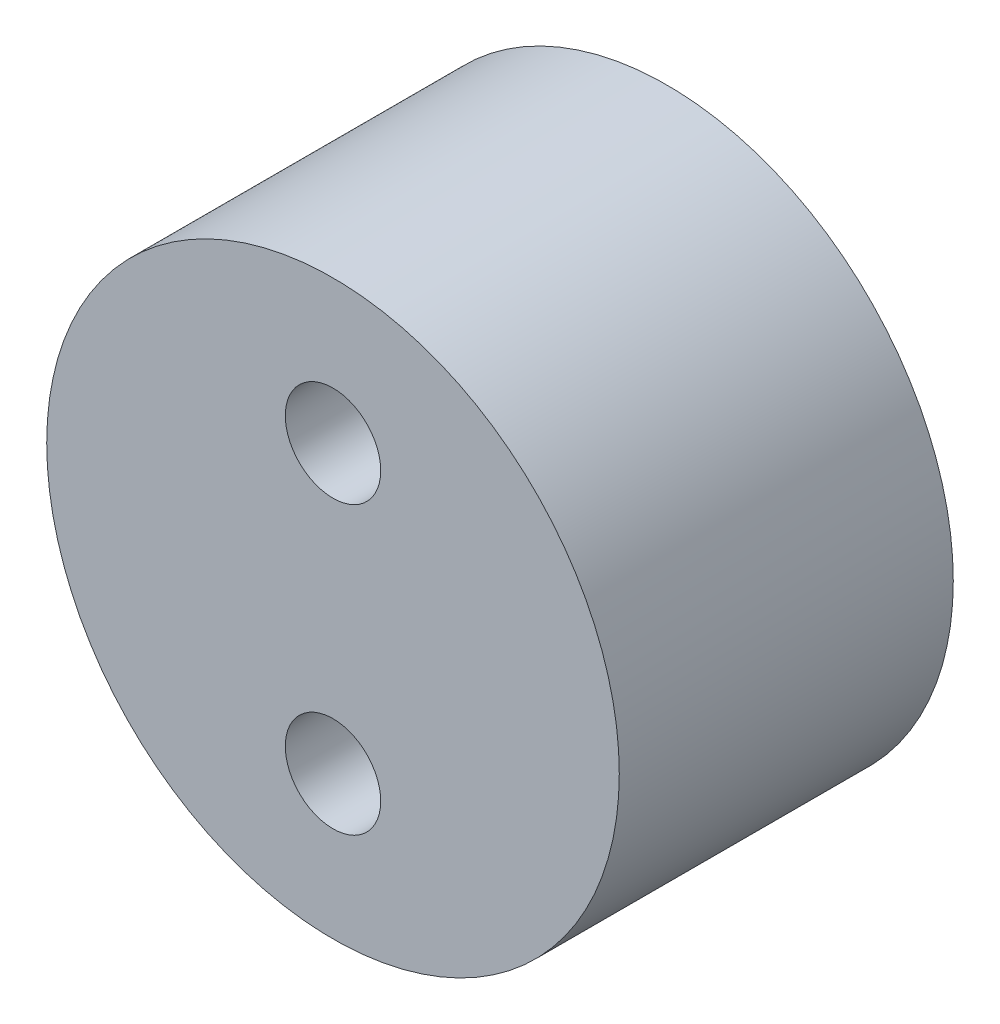
ISO-10303-21;
HEADER;
FILE_DESCRIPTION(('STEP AP214'),'2;1');
FILE_NAME('part.step','',(''),(''),'','','');
FILE_SCHEMA(('AUTOMOTIVE_DESIGN { 1 0 10303 214 1 1 1 1 }'));
ENDSEC;
DATA;
#1=APPLICATION_CONTEXT('core data for automotive mechanical design processes');
#2=APPLICATION_PROTOCOL_DEFINITION('international standard','automotive_design',2000,#1);
#3=PRODUCT_CONTEXT('',#1,'mechanical');
#4=PRODUCT('Part','Part','',(#3));
#5=PRODUCT_RELATED_PRODUCT_CATEGORY('part','',(#4));
#6=PRODUCT_DEFINITION_FORMATION('','',#4);
#7=PRODUCT_DEFINITION_CONTEXT('part definition',#1,'design');
#8=PRODUCT_DEFINITION('design','',#6,#7);
#9=PRODUCT_DEFINITION_SHAPE('','',#8);
#10=(LENGTH_UNIT() NAMED_UNIT(*) SI_UNIT(.MILLI.,.METRE.));
#11=(NAMED_UNIT(*) PLANE_ANGLE_UNIT() SI_UNIT($,.RADIAN.));
#12=(NAMED_UNIT(*) SI_UNIT($,.STERADIAN.) SOLID_ANGLE_UNIT());
#13=UNCERTAINTY_MEASURE_WITH_UNIT(LENGTH_MEASURE(1.E-05),#10,'distance_accuracy_value','');
#14=(GEOMETRIC_REPRESENTATION_CONTEXT(3) GLOBAL_UNCERTAINTY_ASSIGNED_CONTEXT((#13)) GLOBAL_UNIT_ASSIGNED_CONTEXT((#10,
#11,#12)) REPRESENTATION_CONTEXT('',''));
#15=CARTESIAN_POINT('',(0.,0.,0.));
#16=DIRECTION('',(0.,0.,1.));
#17=DIRECTION('',(1.,0.,0.));
#18=AXIS2_PLACEMENT_3D('',#15,#16,#17);
#19=CARTESIAN_POINT('',(0.,0.,17.5));
#20=DIRECTION('',(0.,0.,1.));
#21=DIRECTION('',(1.,0.,0.));
#22=AXIS2_PLACEMENT_3D('',#19,#20,#21);
#23=PLANE('',#22);
#24=CARTESIAN_POINT('',(0.,7.5,17.5));
#25=DIRECTION('',(0.,0.,1.));
#26=DIRECTION('',(1.,0.,0.));
#27=AXIS2_PLACEMENT_3D('',#24,#25,#26);
#28=CIRCLE('',#27,2.5);
#29=CARTESIAN_POINT('',(2.5,7.5,17.5));
#30=VERTEX_POINT('',#29);
#31=EDGE_CURVE('E50',#30,#30,#28,.T.);
#32=ORIENTED_EDGE('',*,*,#31,.F.);
#33=EDGE_LOOP('',(#32));
#34=FACE_BOUND('',#33,.T.);
#35=CARTESIAN_POINT('',(0.,0.,17.5));
#36=DIRECTION('',(0.,0.,1.));
#37=DIRECTION('',(1.,0.,0.));
#38=AXIS2_PLACEMENT_3D('',#35,#36,#37);
#39=CIRCLE('',#38,15.);
#40=CARTESIAN_POINT('',(15.,0.,17.5));
#41=VERTEX_POINT('',#40);
#42=EDGE_CURVE('E10',#41,#41,#39,.T.);
#43=ORIENTED_EDGE('',*,*,#42,.T.);
#44=EDGE_LOOP('',(#43));
#45=FACE_BOUND('',#44,.T.);
#46=CARTESIAN_POINT('',(0.,-7.5,17.5));
#47=DIRECTION('',(0.,0.,1.));
#48=DIRECTION('',(1.,0.,0.));
#49=AXIS2_PLACEMENT_3D('',#46,#47,#48);
#50=CIRCLE('',#49,2.5);
#51=CARTESIAN_POINT('',(2.5,-7.5,17.5));
#52=VERTEX_POINT('',#51);
#53=EDGE_CURVE('E56',#52,#52,#50,.T.);
#54=ORIENTED_EDGE('',*,*,#53,.F.);
#55=EDGE_LOOP('',(#54));
#56=FACE_BOUND('',#55,.T.);
#57=ADVANCED_FACE('F37',(#34,#45,#56),#23,.T.);
#58=CARTESIAN_POINT('',(0.,0.,0.));
#59=DIRECTION('',(0.,0.,1.));
#60=DIRECTION('',(1.,0.,0.));
#61=AXIS2_PLACEMENT_3D('',#58,#59,#60);
#62=PLANE('',#61);
#63=CARTESIAN_POINT('',(0.,0.,0.));
#64=DIRECTION('',(0.,0.,1.));
#65=DIRECTION('',(1.,0.,0.));
#66=AXIS2_PLACEMENT_3D('',#63,#64,#65);
#67=CIRCLE('',#66,15.);
#68=CARTESIAN_POINT('',(15.,0.,0.));
#69=VERTEX_POINT('',#68);
#70=EDGE_CURVE('E41',#69,#69,#67,.T.);
#71=ORIENTED_EDGE('',*,*,#70,.F.);
#72=EDGE_LOOP('',(#71));
#73=FACE_BOUND('',#72,.T.);
#74=CARTESIAN_POINT('',(0.,7.5,0.));
#75=DIRECTION('',(0.,0.,1.));
#76=DIRECTION('',(1.,0.,0.));
#77=AXIS2_PLACEMENT_3D('',#74,#75,#76);
#78=CIRCLE('',#77,2.5);
#79=CARTESIAN_POINT('',(2.5,7.5,0.));
#80=VERTEX_POINT('',#79);
#81=EDGE_CURVE('E52',#80,#80,#78,.T.);
#82=ORIENTED_EDGE('',*,*,#81,.T.);
#83=EDGE_LOOP('',(#82));
#84=FACE_BOUND('',#83,.T.);
#85=CARTESIAN_POINT('',(0.,-7.5,0.));
#86=DIRECTION('',(0.,0.,1.));
#87=DIRECTION('',(1.,0.,0.));
#88=AXIS2_PLACEMENT_3D('',#85,#86,#87);
#89=CIRCLE('',#88,2.5);
#90=CARTESIAN_POINT('',(2.5,-7.5,0.));
#91=VERTEX_POINT('',#90);
#92=EDGE_CURVE('E60',#91,#91,#89,.T.);
#93=ORIENTED_EDGE('',*,*,#92,.T.);
#94=EDGE_LOOP('',(#93));
#95=FACE_BOUND('',#94,.T.);
#96=ADVANCED_FACE('F72',(#73,#84,#95),#62,.F.);
#97=CARTESIAN_POINT('',(0.,0.,17.5));
#98=DIRECTION('',(0.,0.,-1.));
#99=DIRECTION('',(-1.,0.,0.));
#100=AXIS2_PLACEMENT_3D('',#97,#98,#99);
#101=CYLINDRICAL_SURFACE('',#100,15.);
#102=ORIENTED_EDGE('',*,*,#42,.F.);
#103=EDGE_LOOP('',(#102));
#104=FACE_BOUND('',#103,.T.);
#105=ORIENTED_EDGE('',*,*,#70,.T.);
#106=EDGE_LOOP('',(#105));
#107=FACE_BOUND('',#106,.T.);
#108=ADVANCED_FACE('F39',(#104,#107),#101,.T.);
#109=CARTESIAN_POINT('',(0.,7.5,17.5));
#110=DIRECTION('',(0.,0.,-1.));
#111=DIRECTION('',(-1.,0.,0.));
#112=AXIS2_PLACEMENT_3D('',#109,#110,#111);
#113=CYLINDRICAL_SURFACE('',#112,2.5);
#114=ORIENTED_EDGE('',*,*,#31,.T.);
#115=EDGE_LOOP('',(#114));
#116=FACE_BOUND('',#115,.T.);
#117=ORIENTED_EDGE('',*,*,#81,.F.);
#118=EDGE_LOOP('',(#117));
#119=FACE_BOUND('',#118,.T.);
#120=ADVANCED_FACE('F81',(#116,#119),#113,.F.);
#121=CARTESIAN_POINT('',(0.,-7.5,17.5));
#122=DIRECTION('',(0.,0.,-1.));
#123=DIRECTION('',(-1.,0.,0.));
#124=AXIS2_PLACEMENT_3D('',#121,#122,#123);
#125=CYLINDRICAL_SURFACE('',#124,2.5);
#126=ORIENTED_EDGE('',*,*,#53,.T.);
#127=EDGE_LOOP('',(#126));
#128=FACE_BOUND('',#127,.T.);
#129=ORIENTED_EDGE('',*,*,#92,.F.);
#130=EDGE_LOOP('',(#129));
#131=FACE_BOUND('',#130,.T.);
#132=ADVANCED_FACE('F68',(#128,#131),#125,.F.);
#133=CLOSED_SHELL('',(#57,#96,#108,#120,#132));
#134=MANIFOLD_SOLID_BREP('B2',#133);
#135=ADVANCED_BREP_SHAPE_REPRESENTATION('',(#18,#134),#14);
#136=SHAPE_DEFINITION_REPRESENTATION(#9,#135);
ENDSEC;
END-ISO-10303-21;
